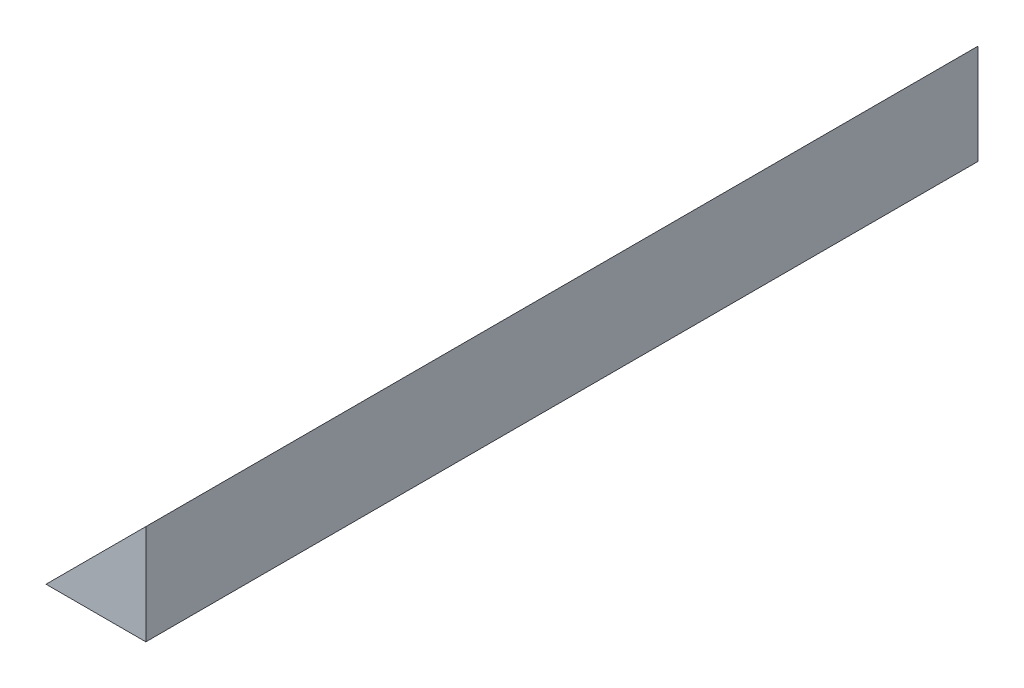
ISO-10303-21;
HEADER;
FILE_DESCRIPTION(('STEP AP214'),'2;1');
FILE_NAME('part.step','',(''),(''),'','','');
FILE_SCHEMA(('AUTOMOTIVE_DESIGN { 1 0 10303 214 1 1 1 1 }'));
ENDSEC;
DATA;
#1=APPLICATION_CONTEXT('core data for automotive mechanical design processes');
#2=APPLICATION_PROTOCOL_DEFINITION('international standard','automotive_design',2000,#1);
#3=PRODUCT_CONTEXT('',#1,'mechanical');
#4=PRODUCT('Part','Part','',(#3));
#5=PRODUCT_RELATED_PRODUCT_CATEGORY('part','',(#4));
#6=PRODUCT_DEFINITION_FORMATION('','',#4);
#7=PRODUCT_DEFINITION_CONTEXT('part definition',#1,'design');
#8=PRODUCT_DEFINITION('design','',#6,#7);
#9=PRODUCT_DEFINITION_SHAPE('','',#8);
#10=(LENGTH_UNIT() NAMED_UNIT(*) SI_UNIT(.MILLI.,.METRE.));
#11=(NAMED_UNIT(*) PLANE_ANGLE_UNIT() SI_UNIT($,.RADIAN.));
#12=(NAMED_UNIT(*) SI_UNIT($,.STERADIAN.) SOLID_ANGLE_UNIT());
#13=UNCERTAINTY_MEASURE_WITH_UNIT(LENGTH_MEASURE(1.E-05),#10,'distance_accuracy_value','');
#14=(GEOMETRIC_REPRESENTATION_CONTEXT(3) GLOBAL_UNCERTAINTY_ASSIGNED_CONTEXT((#13)) GLOBAL_UNIT_ASSIGNED_CONTEXT((#10,
#11,#12)) REPRESENTATION_CONTEXT('',''));
#15=CARTESIAN_POINT('',(0.,0.,0.));
#16=DIRECTION('',(0.,0.,1.));
#17=DIRECTION('',(1.,0.,0.));
#18=AXIS2_PLACEMENT_3D('',#15,#16,#17);
#19=CARTESIAN_POINT('',(0.,6.,50.));
#20=DIRECTION('',(0.707106781186548,-0.707106781186548,0.));
#21=DIRECTION('',(0.707106781186548,0.707106781186548,0.));
#22=AXIS2_PLACEMENT_3D('',#19,#20,#21);
#23=PLANE('',#22);
#24=DIRECTION('',(-0.707106781186548,-0.707106781186548,0.));
#25=VECTOR('',#24,1.);
#26=CARTESIAN_POINT('',(0.,6.,0.));
#27=LINE('',#26,#25);
#28=CARTESIAN_POINT('',(0.,6.,0.));
#29=VERTEX_POINT('',#28);
#30=CARTESIAN_POINT('',(-6.,0.,0.));
#31=VERTEX_POINT('',#30);
#32=EDGE_CURVE('E79',#29,#31,#27,.T.);
#33=ORIENTED_EDGE('',*,*,#32,.T.);
#34=DIRECTION('',(0.,0.,-1.));
#35=VECTOR('',#34,1.);
#36=CARTESIAN_POINT('',(-6.,0.,50.));
#37=LINE('',#36,#35);
#38=CARTESIAN_POINT('',(-6.,0.,50.));
#39=VERTEX_POINT('',#38);
#40=EDGE_CURVE('E11',#39,#31,#37,.T.);
#41=ORIENTED_EDGE('',*,*,#40,.F.);
#42=DIRECTION('',(-0.707106781186548,-0.707106781186548,0.));
#43=VECTOR('',#42,1.);
#44=CARTESIAN_POINT('',(0.,6.,50.));
#45=LINE('',#44,#43);
#46=CARTESIAN_POINT('',(0.,6.,50.));
#47=VERTEX_POINT('',#46);
#48=EDGE_CURVE('E72',#47,#39,#45,.T.);
#49=ORIENTED_EDGE('',*,*,#48,.F.);
#50=DIRECTION('',(0.,0.,-1.));
#51=VECTOR('',#50,1.);
#52=CARTESIAN_POINT('',(0.,6.,50.));
#53=LINE('',#52,#51);
#54=EDGE_CURVE('E80',#47,#29,#53,.T.);
#55=ORIENTED_EDGE('',*,*,#54,.T.);
#56=EDGE_LOOP('',(#33,#41,#49,#55));
#57=FACE_BOUND('',#56,.T.);
#58=ADVANCED_FACE('F32',(#57),#23,.F.);
#59=CARTESIAN_POINT('',(-6.,0.,50.));
#60=DIRECTION('',(0.,1.,0.));
#61=DIRECTION('',(0.,0.,1.));
#62=AXIS2_PLACEMENT_3D('',#59,#60,#61);
#63=PLANE('',#62);
#64=DIRECTION('',(1.,0.,0.));
#65=VECTOR('',#64,1.);
#66=CARTESIAN_POINT('',(-6.,0.,0.));
#67=LINE('',#66,#65);
#68=CARTESIAN_POINT('',(0.,0.,0.));
#69=VERTEX_POINT('',#68);
#70=EDGE_CURVE('E60',#31,#69,#67,.T.);
#71=ORIENTED_EDGE('',*,*,#70,.T.);
#72=DIRECTION('',(0.,0.,-1.));
#73=VECTOR('',#72,1.);
#74=CARTESIAN_POINT('',(0.,0.,50.));
#75=LINE('',#74,#73);
#76=CARTESIAN_POINT('',(0.,0.,50.));
#77=VERTEX_POINT('',#76);
#78=EDGE_CURVE('E40',#77,#69,#75,.T.);
#79=ORIENTED_EDGE('',*,*,#78,.F.);
#80=DIRECTION('',(1.,0.,0.));
#81=VECTOR('',#80,1.);
#82=CARTESIAN_POINT('',(-6.,0.,50.));
#83=LINE('',#82,#81);
#84=EDGE_CURVE('E68',#39,#77,#83,.T.);
#85=ORIENTED_EDGE('',*,*,#84,.F.);
#86=ORIENTED_EDGE('',*,*,#40,.T.);
#87=EDGE_LOOP('',(#71,#79,#85,#86));
#88=FACE_BOUND('',#87,.T.);
#89=ADVANCED_FACE('F69',(#88),#63,.F.);
#90=CARTESIAN_POINT('',(0.,0.,50.));
#91=DIRECTION('',(-1.,0.,0.));
#92=DIRECTION('',(0.,0.,1.));
#93=AXIS2_PLACEMENT_3D('',#90,#91,#92);
#94=PLANE('',#93);
#95=DIRECTION('',(0.,1.,0.));
#96=VECTOR('',#95,1.);
#97=CARTESIAN_POINT('',(0.,0.,0.));
#98=LINE('',#97,#96);
#99=EDGE_CURVE('E65',#69,#29,#98,.T.);
#100=ORIENTED_EDGE('',*,*,#99,.T.);
#101=ORIENTED_EDGE('',*,*,#54,.F.);
#102=DIRECTION('',(0.,1.,0.));
#103=VECTOR('',#102,1.);
#104=CARTESIAN_POINT('',(0.,0.,50.));
#105=LINE('',#104,#103);
#106=EDGE_CURVE('E48',#77,#47,#105,.T.);
#107=ORIENTED_EDGE('',*,*,#106,.F.);
#108=ORIENTED_EDGE('',*,*,#78,.T.);
#109=EDGE_LOOP('',(#100,#101,#107,#108));
#110=FACE_BOUND('',#109,.T.);
#111=ADVANCED_FACE('F87',(#110),#94,.F.);
#112=CARTESIAN_POINT('',(-6.,0.,50.));
#113=DIRECTION('',(0.,0.,1.));
#114=DIRECTION('',(1.,0.,0.));
#115=AXIS2_PLACEMENT_3D('',#112,#113,#114);
#116=PLANE('',#115);
#117=ORIENTED_EDGE('',*,*,#48,.T.);
#118=ORIENTED_EDGE('',*,*,#84,.T.);
#119=ORIENTED_EDGE('',*,*,#106,.T.);
#120=EDGE_LOOP('',(#117,#118,#119));
#121=FACE_BOUND('',#120,.T.);
#122=ADVANCED_FACE('F75',(#121),#116,.T.);
#123=CARTESIAN_POINT('',(-6.,0.,0.));
#124=DIRECTION('',(0.,0.,1.));
#125=DIRECTION('',(1.,0.,0.));
#126=AXIS2_PLACEMENT_3D('',#123,#124,#125);
#127=PLANE('',#126);
#128=ORIENTED_EDGE('',*,*,#32,.F.);
#129=ORIENTED_EDGE('',*,*,#99,.F.);
#130=ORIENTED_EDGE('',*,*,#70,.F.);
#131=EDGE_LOOP('',(#128,#129,#130));
#132=FACE_BOUND('',#131,.T.);
#133=ADVANCED_FACE('F88',(#132),#127,.F.);
#134=CLOSED_SHELL('',(#58,#89,#111,#122,#133));
#135=MANIFOLD_SOLID_BREP('B2',#134);
#136=ADVANCED_BREP_SHAPE_REPRESENTATION('',(#18,#135),#14);
#137=SHAPE_DEFINITION_REPRESENTATION(#9,#136);
ENDSEC;
END-ISO-10303-21;
